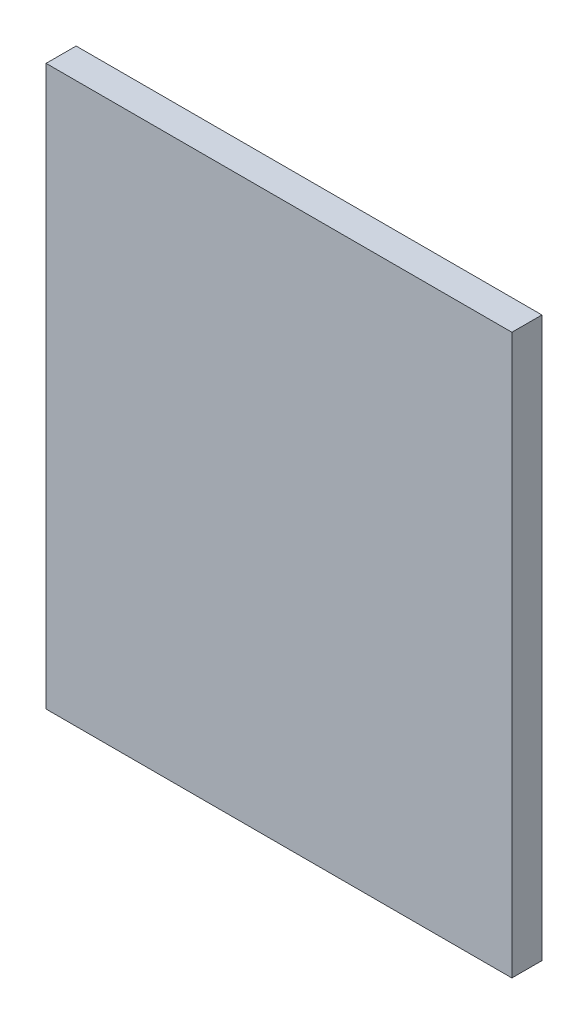
ISO-10303-21;
HEADER;
FILE_DESCRIPTION(('STEP AP214'),'2;1');
FILE_NAME('part.step','',(''),(''),'','','');
FILE_SCHEMA(('AUTOMOTIVE_DESIGN { 1 0 10303 214 1 1 1 1 }'));
ENDSEC;
DATA;
#1=APPLICATION_CONTEXT('core data for automotive mechanical design processes');
#2=APPLICATION_PROTOCOL_DEFINITION('international standard','automotive_design',2000,#1);
#3=PRODUCT_CONTEXT('',#1,'mechanical');
#4=PRODUCT('Part','Part','',(#3));
#5=PRODUCT_RELATED_PRODUCT_CATEGORY('part','',(#4));
#6=PRODUCT_DEFINITION_FORMATION('','',#4);
#7=PRODUCT_DEFINITION_CONTEXT('part definition',#1,'design');
#8=PRODUCT_DEFINITION('design','',#6,#7);
#9=PRODUCT_DEFINITION_SHAPE('','',#8);
#10=(LENGTH_UNIT() NAMED_UNIT(*) SI_UNIT(.MILLI.,.METRE.));
#11=(NAMED_UNIT(*) PLANE_ANGLE_UNIT() SI_UNIT($,.RADIAN.));
#12=(NAMED_UNIT(*) SI_UNIT($,.STERADIAN.) SOLID_ANGLE_UNIT());
#13=UNCERTAINTY_MEASURE_WITH_UNIT(LENGTH_MEASURE(1.E-05),#10,'distance_accuracy_value','');
#14=(GEOMETRIC_REPRESENTATION_CONTEXT(3) GLOBAL_UNCERTAINTY_ASSIGNED_CONTEXT((#13)) GLOBAL_UNIT_ASSIGNED_CONTEXT((#10,
#11,#12)) REPRESENTATION_CONTEXT('',''));
#15=CARTESIAN_POINT('',(0.,0.,0.));
#16=DIRECTION('',(0.,0.,1.));
#17=DIRECTION('',(1.,0.,0.));
#18=AXIS2_PLACEMENT_3D('',#15,#16,#17);
#19=CARTESIAN_POINT('',(0.,0.,0.));
#20=DIRECTION('',(0.,0.,-1.));
#21=DIRECTION('',(-1.,0.,0.));
#22=AXIS2_PLACEMENT_3D('',#19,#20,#21);
#23=PLANE('',#22);
#24=DIRECTION('',(0.,-1.,0.));
#25=VECTOR('',#24,1.);
#26=CARTESIAN_POINT('',(6.98000000107208,8.38000000170986,0.));
#27=LINE('',#26,#25);
#28=CARTESIAN_POINT('',(6.98000000107208,8.38000000170986,0.));
#29=VERTEX_POINT('',#28);
#30=CARTESIAN_POINT('',(6.98000000107195,0.,0.));
#31=VERTEX_POINT('',#30);
#32=EDGE_CURVE('E55',#29,#31,#27,.T.);
#33=ORIENTED_EDGE('',*,*,#32,.T.);
#34=DIRECTION('',(-1.,0.,0.));
#35=VECTOR('',#34,1.);
#36=CARTESIAN_POINT('',(6.98000000107191,0.,0.));
#37=LINE('',#36,#35);
#38=CARTESIAN_POINT('',(0.,0.,0.));
#39=VERTEX_POINT('',#38);
#40=EDGE_CURVE('E76',#31,#39,#37,.T.);
#41=ORIENTED_EDGE('',*,*,#40,.T.);
#42=DIRECTION('',(0.,1.,0.));
#43=VECTOR('',#42,1.);
#44=CARTESIAN_POINT('',(0.,0.,0.));
#45=LINE('',#44,#43);
#46=CARTESIAN_POINT('',(1.1539214028744E-13,8.38000000170986,0.));
#47=VERTEX_POINT('',#46);
#48=EDGE_CURVE('E58',#39,#47,#45,.T.);
#49=ORIENTED_EDGE('',*,*,#48,.T.);
#50=DIRECTION('',(1.,0.,0.));
#51=VECTOR('',#50,1.);
#52=CARTESIAN_POINT('',(1.53704604599625E-13,8.38000000170986,0.));
#53=LINE('',#52,#51);
#54=EDGE_CURVE('E20',#47,#29,#53,.T.);
#55=ORIENTED_EDGE('',*,*,#54,.T.);
#56=EDGE_LOOP('',(#33,#41,#49,#55));
#57=FACE_BOUND('',#56,.T.);
#58=ADVANCED_FACE('F17',(#57),#23,.T.);
#59=CARTESIAN_POINT('',(1.53704604599625E-13,8.38000000170986,0.45));
#60=DIRECTION('',(0.,-1.,0.));
#61=DIRECTION('',(0.,0.,-1.));
#62=AXIS2_PLACEMENT_3D('',#59,#60,#61);
#63=PLANE('',#62);
#64=DIRECTION('',(0.,0.,1.));
#65=VECTOR('',#64,1.);
#66=CARTESIAN_POINT('',(1.53704604599625E-13,8.38000000170986,0.45));
#67=LINE('',#66,#65);
#68=CARTESIAN_POINT('',(1.1539214028744E-13,8.38000000170986,0.45));
#69=VERTEX_POINT('',#68);
#70=EDGE_CURVE('E78',#47,#69,#67,.T.);
#71=ORIENTED_EDGE('',*,*,#70,.T.);
#72=DIRECTION('',(-1.,0.,0.));
#73=VECTOR('',#72,1.);
#74=CARTESIAN_POINT('',(0.,8.38000000170986,0.45));
#75=LINE('',#74,#73);
#76=CARTESIAN_POINT('',(6.98000000107208,8.38000000170986,0.45));
#77=VERTEX_POINT('',#76);
#78=EDGE_CURVE('E73',#69,#77,#75,.F.);
#79=ORIENTED_EDGE('',*,*,#78,.T.);
#80=DIRECTION('',(0.,0.,1.));
#81=VECTOR('',#80,1.);
#82=CARTESIAN_POINT('',(6.98000000107208,8.38000000170986,0.45));
#83=LINE('',#82,#81);
#84=EDGE_CURVE('E63',#77,#29,#83,.F.);
#85=ORIENTED_EDGE('',*,*,#84,.T.);
#86=ORIENTED_EDGE('',*,*,#54,.F.);
#87=EDGE_LOOP('',(#71,#79,#85,#86));
#88=FACE_BOUND('',#87,.T.);
#89=ADVANCED_FACE('F72',(#88),#63,.F.);
#90=CARTESIAN_POINT('',(6.98000000107208,8.38000000170986,0.45));
#91=DIRECTION('',(-1.,0.,0.));
#92=DIRECTION('',(0.,-1.,0.));
#93=AXIS2_PLACEMENT_3D('',#90,#91,#92);
#94=PLANE('',#93);
#95=ORIENTED_EDGE('',*,*,#84,.F.);
#96=DIRECTION('',(0.,1.,0.));
#97=VECTOR('',#96,1.);
#98=CARTESIAN_POINT('',(6.98000000107208,0.,0.45));
#99=LINE('',#98,#97);
#100=CARTESIAN_POINT('',(6.98000000107195,0.,0.45));
#101=VERTEX_POINT('',#100);
#102=EDGE_CURVE('E83',#77,#101,#99,.F.);
#103=ORIENTED_EDGE('',*,*,#102,.T.);
#104=DIRECTION('',(0.,0.,1.));
#105=VECTOR('',#104,1.);
#106=CARTESIAN_POINT('',(6.98000000107191,0.,0.45));
#107=LINE('',#106,#105);
#108=EDGE_CURVE('E69',#101,#31,#107,.F.);
#109=ORIENTED_EDGE('',*,*,#108,.T.);
#110=ORIENTED_EDGE('',*,*,#32,.F.);
#111=EDGE_LOOP('',(#95,#103,#109,#110));
#112=FACE_BOUND('',#111,.T.);
#113=ADVANCED_FACE('F66',(#112),#94,.F.);
#114=CARTESIAN_POINT('',(6.98000000107191,0.,0.45));
#115=DIRECTION('',(0.,1.,0.));
#116=DIRECTION('',(-1.,0.,0.));
#117=AXIS2_PLACEMENT_3D('',#114,#115,#116);
#118=PLANE('',#117);
#119=ORIENTED_EDGE('',*,*,#108,.F.);
#120=DIRECTION('',(-1.,0.,0.));
#121=VECTOR('',#120,1.);
#122=CARTESIAN_POINT('',(0.,0.,0.45));
#123=LINE('',#122,#121);
#124=CARTESIAN_POINT('',(0.,0.,0.45));
#125=VERTEX_POINT('',#124);
#126=EDGE_CURVE('E26',#101,#125,#123,.T.);
#127=ORIENTED_EDGE('',*,*,#126,.T.);
#128=DIRECTION('',(0.,0.,1.));
#129=VECTOR('',#128,1.);
#130=CARTESIAN_POINT('',(0.,0.,0.45));
#131=LINE('',#130,#129);
#132=EDGE_CURVE('E34',#125,#39,#131,.F.);
#133=ORIENTED_EDGE('',*,*,#132,.T.);
#134=ORIENTED_EDGE('',*,*,#40,.F.);
#135=EDGE_LOOP('',(#119,#127,#133,#134));
#136=FACE_BOUND('',#135,.T.);
#137=ADVANCED_FACE('F88',(#136),#118,.F.);
#138=CARTESIAN_POINT('',(0.,0.,0.45));
#139=DIRECTION('',(1.,0.,0.));
#140=DIRECTION('',(0.,1.,0.));
#141=AXIS2_PLACEMENT_3D('',#138,#139,#140);
#142=PLANE('',#141);
#143=ORIENTED_EDGE('',*,*,#132,.F.);
#144=DIRECTION('',(0.,1.,0.));
#145=VECTOR('',#144,1.);
#146=CARTESIAN_POINT('',(0.,0.,0.45));
#147=LINE('',#146,#145);
#148=EDGE_CURVE('E11',#125,#69,#147,.T.);
#149=ORIENTED_EDGE('',*,*,#148,.T.);
#150=ORIENTED_EDGE('',*,*,#70,.F.);
#151=ORIENTED_EDGE('',*,*,#48,.F.);
#152=EDGE_LOOP('',(#143,#149,#150,#151));
#153=FACE_BOUND('',#152,.T.);
#154=ADVANCED_FACE('F91',(#153),#142,.F.);
#155=CARTESIAN_POINT('',(0.,0.,0.45));
#156=DIRECTION('',(0.,0.,-1.));
#157=DIRECTION('',(-1.,0.,0.));
#158=AXIS2_PLACEMENT_3D('',#155,#156,#157);
#159=PLANE('',#158);
#160=ORIENTED_EDGE('',*,*,#126,.F.);
#161=ORIENTED_EDGE('',*,*,#102,.F.);
#162=ORIENTED_EDGE('',*,*,#78,.F.);
#163=ORIENTED_EDGE('',*,*,#148,.F.);
#164=EDGE_LOOP('',(#160,#161,#162,#163));
#165=FACE_BOUND('',#164,.T.);
#166=ADVANCED_FACE('F90',(#165),#159,.F.);
#167=CLOSED_SHELL('',(#58,#89,#113,#137,#154,#166));
#168=MANIFOLD_SOLID_BREP('B1',#167);
#169=ADVANCED_BREP_SHAPE_REPRESENTATION('',(#18,#168),#14);
#170=SHAPE_DEFINITION_REPRESENTATION(#9,#169);
ENDSEC;
END-ISO-10303-21;
